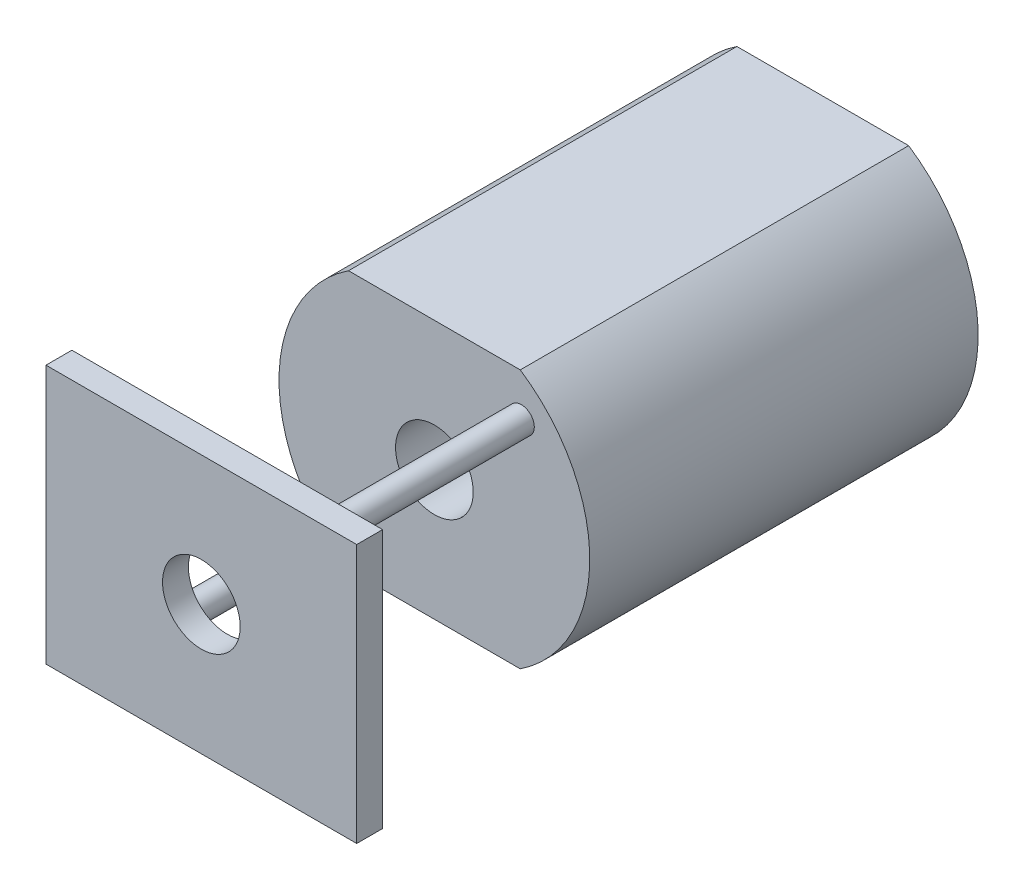
ISO-10303-21;
HEADER;
FILE_DESCRIPTION(('STEP AP214'),'2;1');
FILE_NAME('part.step','',(''),(''),'','','');
FILE_SCHEMA(('AUTOMOTIVE_DESIGN { 1 0 10303 214 1 1 1 1 }'));
ENDSEC;
DATA;
#1=APPLICATION_CONTEXT('core data for automotive mechanical design processes');
#2=APPLICATION_PROTOCOL_DEFINITION('international standard','automotive_design',2000,#1);
#3=PRODUCT_CONTEXT('',#1,'mechanical');
#4=PRODUCT('Part','Part','',(#3));
#5=PRODUCT_RELATED_PRODUCT_CATEGORY('part','',(#4));
#6=PRODUCT_DEFINITION_FORMATION('','',#4);
#7=PRODUCT_DEFINITION_CONTEXT('part definition',#1,'design');
#8=PRODUCT_DEFINITION('design','',#6,#7);
#9=PRODUCT_DEFINITION_SHAPE('','',#8);
#10=(LENGTH_UNIT() NAMED_UNIT(*) SI_UNIT(.MILLI.,.METRE.));
#11=(NAMED_UNIT(*) PLANE_ANGLE_UNIT() SI_UNIT($,.RADIAN.));
#12=(NAMED_UNIT(*) SI_UNIT($,.STERADIAN.) SOLID_ANGLE_UNIT());
#13=UNCERTAINTY_MEASURE_WITH_UNIT(LENGTH_MEASURE(1.E-05),#10,'distance_accuracy_value','');
#14=(GEOMETRIC_REPRESENTATION_CONTEXT(3) GLOBAL_UNCERTAINTY_ASSIGNED_CONTEXT((#13)) GLOBAL_UNIT_ASSIGNED_CONTEXT((#10,
#11,#12)) REPRESENTATION_CONTEXT('',''));
#15=CARTESIAN_POINT('',(0.,0.,0.));
#16=DIRECTION('',(0.,0.,1.));
#17=DIRECTION('',(1.,0.,0.));
#18=AXIS2_PLACEMENT_3D('',#15,#16,#17);
#19=CARTESIAN_POINT('',(0.,0.,7.5));
#20=DIRECTION('',(0.,0.,-1.));
#21=DIRECTION('',(-1.,0.,0.));
#22=AXIS2_PLACEMENT_3D('',#19,#20,#21);
#23=CYLINDRICAL_SURFACE('',#22,6.);
#24=CARTESIAN_POINT('',(0.,0.,-7.5));
#25=DIRECTION('',(0.,0.,1.));
#26=DIRECTION('',(1.,0.,0.));
#27=AXIS2_PLACEMENT_3D('',#24,#25,#26);
#28=CIRCLE('',#27,6.);
#29=CARTESIAN_POINT('',(-3.3166247903554,5.,-7.5));
#30=VERTEX_POINT('',#29);
#31=CARTESIAN_POINT('',(-3.3166247903554,-5.,-7.5));
#32=VERTEX_POINT('',#31);
#33=EDGE_CURVE('E172',#30,#32,#28,.T.);
#34=ORIENTED_EDGE('',*,*,#33,.T.);
#35=DIRECTION('',(0.,0.,-1.));
#36=VECTOR('',#35,1.);
#37=CARTESIAN_POINT('',(-3.3166247903554,-5.,7.5));
#38=LINE('',#37,#36);
#39=CARTESIAN_POINT('',(-3.3166247903554,-5.,7.5));
#40=VERTEX_POINT('',#39);
#41=EDGE_CURVE('E48',#40,#32,#38,.T.);
#42=ORIENTED_EDGE('',*,*,#41,.F.);
#43=CARTESIAN_POINT('',(0.,0.,7.5));
#44=DIRECTION('',(0.,0.,1.));
#45=DIRECTION('',(1.,0.,0.));
#46=AXIS2_PLACEMENT_3D('',#43,#44,#45);
#47=CIRCLE('',#46,6.);
#48=CARTESIAN_POINT('',(-3.3166247903554,5.,7.5));
#49=VERTEX_POINT('',#48);
#50=EDGE_CURVE('E174',#49,#40,#47,.T.);
#51=ORIENTED_EDGE('',*,*,#50,.F.);
#52=DIRECTION('',(0.,0.,-1.));
#53=VECTOR('',#52,1.);
#54=CARTESIAN_POINT('',(-3.3166247903554,5.,7.5));
#55=LINE('',#54,#53);
#56=EDGE_CURVE('E180',#49,#30,#55,.T.);
#57=ORIENTED_EDGE('',*,*,#56,.T.);
#58=EDGE_LOOP('',(#34,#42,#51,#57));
#59=FACE_BOUND('',#58,.T.);
#60=ADVANCED_FACE('F39',(#59),#23,.T.);
#61=CARTESIAN_POINT('',(-3.3166247903554,-5.,7.5));
#62=DIRECTION('',(0.,1.,0.));
#63=DIRECTION('',(0.,0.,1.));
#64=AXIS2_PLACEMENT_3D('',#61,#62,#63);
#65=PLANE('',#64);
#66=DIRECTION('',(1.,0.,0.));
#67=VECTOR('',#66,1.);
#68=CARTESIAN_POINT('',(-3.3166247903554,-5.,-7.5));
#69=LINE('',#68,#67);
#70=CARTESIAN_POINT('',(3.3166247903554,-5.,-7.5));
#71=VERTEX_POINT('',#70);
#72=EDGE_CURVE('E183',#32,#71,#69,.T.);
#73=ORIENTED_EDGE('',*,*,#72,.T.);
#74=DIRECTION('',(0.,0.,-1.));
#75=VECTOR('',#74,1.);
#76=CARTESIAN_POINT('',(3.3166247903554,-5.,7.5));
#77=LINE('',#76,#75);
#78=CARTESIAN_POINT('',(3.3166247903554,-5.,7.5));
#79=VERTEX_POINT('',#78);
#80=EDGE_CURVE('E190',#79,#71,#77,.T.);
#81=ORIENTED_EDGE('',*,*,#80,.F.);
#82=DIRECTION('',(1.,0.,0.));
#83=VECTOR('',#82,1.);
#84=CARTESIAN_POINT('',(-3.3166247903554,-5.,7.5));
#85=LINE('',#84,#83);
#86=EDGE_CURVE('E89',#40,#79,#85,.T.);
#87=ORIENTED_EDGE('',*,*,#86,.F.);
#88=ORIENTED_EDGE('',*,*,#41,.T.);
#89=EDGE_LOOP('',(#73,#81,#87,#88));
#90=FACE_BOUND('',#89,.T.);
#91=ADVANCED_FACE('F192',(#90),#65,.F.);
#92=CARTESIAN_POINT('',(0.,0.,7.5));
#93=DIRECTION('',(0.,0.,-1.));
#94=DIRECTION('',(-1.,0.,0.));
#95=AXIS2_PLACEMENT_3D('',#92,#93,#94);
#96=CYLINDRICAL_SURFACE('',#95,6.);
#97=CARTESIAN_POINT('',(0.,0.,-7.5));
#98=DIRECTION('',(0.,0.,1.));
#99=DIRECTION('',(1.,0.,0.));
#100=AXIS2_PLACEMENT_3D('',#97,#98,#99);
#101=CIRCLE('',#100,6.);
#102=CARTESIAN_POINT('',(3.3166247903554,5.,-7.5));
#103=VERTEX_POINT('',#102);
#104=EDGE_CURVE('E75',#71,#103,#101,.T.);
#105=ORIENTED_EDGE('',*,*,#104,.T.);
#106=DIRECTION('',(0.,0.,-1.));
#107=VECTOR('',#106,1.);
#108=CARTESIAN_POINT('',(3.3166247903554,5.,7.5));
#109=LINE('',#108,#107);
#110=CARTESIAN_POINT('',(3.3166247903554,5.,7.5));
#111=VERTEX_POINT('',#110);
#112=EDGE_CURVE('E188',#111,#103,#109,.T.);
#113=ORIENTED_EDGE('',*,*,#112,.F.);
#114=CARTESIAN_POINT('',(0.,0.,7.5));
#115=DIRECTION('',(0.,0.,1.));
#116=DIRECTION('',(1.,0.,0.));
#117=AXIS2_PLACEMENT_3D('',#114,#115,#116);
#118=CIRCLE('',#117,6.);
#119=EDGE_CURVE('E177',#79,#111,#118,.T.);
#120=ORIENTED_EDGE('',*,*,#119,.F.);
#121=ORIENTED_EDGE('',*,*,#80,.T.);
#122=EDGE_LOOP('',(#105,#113,#120,#121));
#123=FACE_BOUND('',#122,.T.);
#124=ADVANCED_FACE('F219',(#123),#96,.T.);
#125=CARTESIAN_POINT('',(-3.3166247903554,5.,7.5));
#126=DIRECTION('',(0.,-1.,0.));
#127=DIRECTION('',(0.,0.,-1.));
#128=AXIS2_PLACEMENT_3D('',#125,#126,#127);
#129=PLANE('',#128);
#130=DIRECTION('',(-1.,0.,0.));
#131=VECTOR('',#130,1.);
#132=CARTESIAN_POINT('',(-3.3166247903554,5.,-7.5));
#133=LINE('',#132,#131);
#134=EDGE_CURVE('E81',#103,#30,#133,.T.);
#135=ORIENTED_EDGE('',*,*,#134,.T.);
#136=ORIENTED_EDGE('',*,*,#56,.F.);
#137=DIRECTION('',(-1.,0.,0.));
#138=VECTOR('',#137,1.);
#139=CARTESIAN_POINT('',(-3.3166247903554,5.,7.5));
#140=LINE('',#139,#138);
#141=EDGE_CURVE('E57',#111,#49,#140,.T.);
#142=ORIENTED_EDGE('',*,*,#141,.F.);
#143=ORIENTED_EDGE('',*,*,#112,.T.);
#144=EDGE_LOOP('',(#135,#136,#142,#143));
#145=FACE_BOUND('',#144,.T.);
#146=ADVANCED_FACE('F210',(#145),#129,.F.);
#147=CARTESIAN_POINT('',(0.,0.,7.5));
#148=DIRECTION('',(0.,0.,1.));
#149=DIRECTION('',(1.,0.,0.));
#150=AXIS2_PLACEMENT_3D('',#147,#148,#149);
#151=PLANE('',#150);
#152=CARTESIAN_POINT('',(0.,0.,7.5));
#153=DIRECTION('',(0.,0.,1.));
#154=DIRECTION('',(1.,0.,0.));
#155=AXIS2_PLACEMENT_3D('',#152,#153,#154);
#156=CIRCLE('',#155,1.5);
#157=CARTESIAN_POINT('',(1.5,0.,7.5));
#158=VERTEX_POINT('',#157);
#159=EDGE_CURVE('E147',#158,#158,#156,.T.);
#160=ORIENTED_EDGE('',*,*,#159,.F.);
#161=EDGE_LOOP('',(#160));
#162=FACE_BOUND('',#161,.T.);
#163=CARTESIAN_POINT('',(-3.35875721063612,-3.35875721063608,7.5));
#164=DIRECTION('',(0.,0.,1.));
#165=DIRECTION('',(1.,0.,0.));
#166=AXIS2_PLACEMENT_3D('',#163,#164,#165);
#167=CIRCLE('',#166,0.5);
#168=CARTESIAN_POINT('',(-2.85875721063612,-3.35875721063608,7.5));
#169=VERTEX_POINT('',#168);
#170=EDGE_CURVE('E164',#169,#169,#167,.T.);
#171=ORIENTED_EDGE('',*,*,#170,.F.);
#172=EDGE_LOOP('',(#171));
#173=FACE_BOUND('',#172,.T.);
#174=CARTESIAN_POINT('',(3.35875721063612,3.35875721063608,7.5));
#175=DIRECTION('',(0.,0.,1.));
#176=DIRECTION('',(1.,0.,0.));
#177=AXIS2_PLACEMENT_3D('',#174,#175,#176);
#178=CIRCLE('',#177,0.5);
#179=CARTESIAN_POINT('',(3.85875721063612,3.35875721063608,7.5));
#180=VERTEX_POINT('',#179);
#181=EDGE_CURVE('E167',#180,#180,#178,.T.);
#182=ORIENTED_EDGE('',*,*,#181,.F.);
#183=EDGE_LOOP('',(#182));
#184=FACE_BOUND('',#183,.T.);
#185=ORIENTED_EDGE('',*,*,#50,.T.);
#186=ORIENTED_EDGE('',*,*,#86,.T.);
#187=ORIENTED_EDGE('',*,*,#119,.T.);
#188=ORIENTED_EDGE('',*,*,#141,.T.);
#189=EDGE_LOOP('',(#185,#186,#187,#188));
#190=FACE_BOUND('',#189,.T.);
#191=ADVANCED_FACE('F200',(#162,#173,#184,#190),#151,.T.);
#192=CARTESIAN_POINT('',(0.,0.,-7.5));
#193=DIRECTION('',(0.,0.,1.));
#194=DIRECTION('',(1.,0.,0.));
#195=AXIS2_PLACEMENT_3D('',#192,#193,#194);
#196=PLANE('',#195);
#197=CARTESIAN_POINT('',(0.,0.,-7.5));
#198=DIRECTION('',(0.,0.,-1.));
#199=DIRECTION('',(-1.,0.,0.));
#200=AXIS2_PLACEMENT_3D('',#197,#198,#199);
#201=CIRCLE('',#200,2.5);
#202=CARTESIAN_POINT('',(-2.5,0.,-7.5));
#203=VERTEX_POINT('',#202);
#204=EDGE_CURVE('E11',#203,#203,#201,.T.);
#205=ORIENTED_EDGE('',*,*,#204,.F.);
#206=EDGE_LOOP('',(#205));
#207=FACE_BOUND('',#206,.T.);
#208=ORIENTED_EDGE('',*,*,#33,.F.);
#209=ORIENTED_EDGE('',*,*,#134,.F.);
#210=ORIENTED_EDGE('',*,*,#104,.F.);
#211=ORIENTED_EDGE('',*,*,#72,.F.);
#212=EDGE_LOOP('',(#208,#209,#210,#211));
#213=FACE_BOUND('',#212,.T.);
#214=ADVANCED_FACE('F197',(#207,#213),#196,.F.);
#215=CARTESIAN_POINT('',(0.,0.,-8.5));
#216=DIRECTION('',(0.,0.,1.));
#217=DIRECTION('',(1.,0.,0.));
#218=AXIS2_PLACEMENT_3D('',#215,#216,#217);
#219=CYLINDRICAL_SURFACE('',#218,2.5);
#220=CARTESIAN_POINT('',(0.,0.,-8.5));
#221=DIRECTION('',(0.,0.,-1.));
#222=DIRECTION('',(-1.,0.,0.));
#223=AXIS2_PLACEMENT_3D('',#220,#221,#222);
#224=CIRCLE('',#223,2.5);
#225=CARTESIAN_POINT('',(-2.5,0.,-8.5));
#226=VERTEX_POINT('',#225);
#227=EDGE_CURVE('E170',#226,#226,#224,.T.);
#228=ORIENTED_EDGE('',*,*,#227,.F.);
#229=EDGE_LOOP('',(#228));
#230=FACE_BOUND('',#229,.T.);
#231=ORIENTED_EDGE('',*,*,#204,.T.);
#232=EDGE_LOOP('',(#231));
#233=FACE_BOUND('',#232,.T.);
#234=ADVANCED_FACE('F199',(#230,#233),#219,.T.);
#235=CARTESIAN_POINT('',(0.,0.,-8.5));
#236=DIRECTION('',(0.,0.,-1.));
#237=DIRECTION('',(-1.,0.,0.));
#238=AXIS2_PLACEMENT_3D('',#235,#236,#237);
#239=PLANE('',#238);
#240=CARTESIAN_POINT('',(0.,0.,-8.5));
#241=DIRECTION('',(0.,0.,1.));
#242=DIRECTION('',(1.,0.,0.));
#243=AXIS2_PLACEMENT_3D('',#240,#241,#242);
#244=CIRCLE('',#243,1.5);
#245=CARTESIAN_POINT('',(1.5,0.,-8.5));
#246=VERTEX_POINT('',#245);
#247=EDGE_CURVE('E426',#246,#246,#244,.T.);
#248=ORIENTED_EDGE('',*,*,#247,.T.);
#249=EDGE_LOOP('',(#248));
#250=FACE_BOUND('',#249,.T.);
#251=ORIENTED_EDGE('',*,*,#227,.T.);
#252=EDGE_LOOP('',(#251));
#253=FACE_BOUND('',#252,.T.);
#254=ADVANCED_FACE('F207',(#250,#253),#239,.T.);
#255=CARTESIAN_POINT('',(3.35875721063612,3.35875721063608,16.5));
#256=DIRECTION('',(0.,0.,-1.));
#257=DIRECTION('',(-1.,0.,0.));
#258=AXIS2_PLACEMENT_3D('',#255,#256,#257);
#259=CYLINDRICAL_SURFACE('',#258,0.5);
#260=CARTESIAN_POINT('',(3.35875721063612,3.35875721063608,15.5));
#261=DIRECTION('',(0.,0.,-1.));
#262=DIRECTION('',(-1.,0.,0.));
#263=AXIS2_PLACEMENT_3D('',#260,#261,#262);
#264=CIRCLE('',#263,0.5);
#265=CARTESIAN_POINT('',(2.85875721063612,3.35875721063608,15.5));
#266=VERTEX_POINT('',#265);
#267=EDGE_CURVE('E161',#266,#266,#264,.T.);
#268=ORIENTED_EDGE('',*,*,#267,.T.);
#269=EDGE_LOOP('',(#268));
#270=FACE_BOUND('',#269,.T.);
#271=ORIENTED_EDGE('',*,*,#181,.T.);
#272=EDGE_LOOP('',(#271));
#273=FACE_BOUND('',#272,.T.);
#274=ADVANCED_FACE('F249',(#270,#273),#259,.T.);
#275=CARTESIAN_POINT('',(-3.35875721063612,-3.35875721063608,16.5));
#276=DIRECTION('',(0.,0.,-1.));
#277=DIRECTION('',(-1.,0.,0.));
#278=AXIS2_PLACEMENT_3D('',#275,#276,#277);
#279=CYLINDRICAL_SURFACE('',#278,0.5);
#280=CARTESIAN_POINT('',(-3.35875721063612,-3.35875721063608,15.5));
#281=DIRECTION('',(0.,0.,-1.));
#282=DIRECTION('',(-1.,0.,0.));
#283=AXIS2_PLACEMENT_3D('',#280,#281,#282);
#284=CIRCLE('',#283,0.5);
#285=CARTESIAN_POINT('',(-3.85875721063612,-3.35875721063608,15.5));
#286=VERTEX_POINT('',#285);
#287=EDGE_CURVE('E42',#286,#286,#284,.T.);
#288=ORIENTED_EDGE('',*,*,#287,.T.);
#289=EDGE_LOOP('',(#288));
#290=FACE_BOUND('',#289,.T.);
#291=ORIENTED_EDGE('',*,*,#170,.T.);
#292=EDGE_LOOP('',(#291));
#293=FACE_BOUND('',#292,.T.);
#294=ADVANCED_FACE('F332',(#290,#293),#279,.T.);
#295=CARTESIAN_POINT('',(6.,-5.,15.5));
#296=DIRECTION('',(1.,0.,0.));
#297=DIRECTION('',(0.,0.,-1.));
#298=AXIS2_PLACEMENT_3D('',#295,#296,#297);
#299=PLANE('',#298);
#300=DIRECTION('',(0.,1.,0.));
#301=VECTOR('',#300,1.);
#302=CARTESIAN_POINT('',(6.,-5.,16.5));
#303=LINE('',#302,#301);
#304=CARTESIAN_POINT('',(6.,-5.,16.5));
#305=VERTEX_POINT('',#304);
#306=CARTESIAN_POINT('',(6.,5.,16.5));
#307=VERTEX_POINT('',#306);
#308=EDGE_CURVE('E152',#305,#307,#303,.T.);
#309=ORIENTED_EDGE('',*,*,#308,.F.);
#310=DIRECTION('',(0.,0.,1.));
#311=VECTOR('',#310,1.);
#312=CARTESIAN_POINT('',(6.,-5.,15.5));
#313=LINE('',#312,#311);
#314=CARTESIAN_POINT('',(6.,-5.,15.5));
#315=VERTEX_POINT('',#314);
#316=EDGE_CURVE('E140',#315,#305,#313,.T.);
#317=ORIENTED_EDGE('',*,*,#316,.F.);
#318=DIRECTION('',(0.,1.,0.));
#319=VECTOR('',#318,1.);
#320=CARTESIAN_POINT('',(6.,-5.,15.5));
#321=LINE('',#320,#319);
#322=CARTESIAN_POINT('',(6.,5.,15.5));
#323=VERTEX_POINT('',#322);
#324=EDGE_CURVE('E134',#315,#323,#321,.T.);
#325=ORIENTED_EDGE('',*,*,#324,.T.);
#326=DIRECTION('',(0.,0.,1.));
#327=VECTOR('',#326,1.);
#328=CARTESIAN_POINT('',(6.,5.,15.5));
#329=LINE('',#328,#327);
#330=EDGE_CURVE('E116',#323,#307,#329,.T.);
#331=ORIENTED_EDGE('',*,*,#330,.T.);
#332=EDGE_LOOP('',(#309,#317,#325,#331));
#333=FACE_BOUND('',#332,.T.);
#334=ADVANCED_FACE('F139',(#333),#299,.T.);
#335=CARTESIAN_POINT('',(-6.,-5.,15.5));
#336=DIRECTION('',(0.,-1.,0.));
#337=DIRECTION('',(0.,0.,-1.));
#338=AXIS2_PLACEMENT_3D('',#335,#336,#337);
#339=PLANE('',#338);
#340=DIRECTION('',(1.,0.,0.));
#341=VECTOR('',#340,1.);
#342=CARTESIAN_POINT('',(-6.,-5.,16.5));
#343=LINE('',#342,#341);
#344=CARTESIAN_POINT('',(-6.,-5.,16.5));
#345=VERTEX_POINT('',#344);
#346=EDGE_CURVE('E141',#345,#305,#343,.T.);
#347=ORIENTED_EDGE('',*,*,#346,.F.);
#348=DIRECTION('',(0.,0.,1.));
#349=VECTOR('',#348,1.);
#350=CARTESIAN_POINT('',(-6.,-5.,15.5));
#351=LINE('',#350,#349);
#352=CARTESIAN_POINT('',(-6.,-5.,15.5));
#353=VERTEX_POINT('',#352);
#354=EDGE_CURVE('E158',#353,#345,#351,.T.);
#355=ORIENTED_EDGE('',*,*,#354,.F.);
#356=DIRECTION('',(1.,0.,0.));
#357=VECTOR('',#356,1.);
#358=CARTESIAN_POINT('',(-6.,-5.,15.5));
#359=LINE('',#358,#357);
#360=EDGE_CURVE('E127',#353,#315,#359,.T.);
#361=ORIENTED_EDGE('',*,*,#360,.T.);
#362=ORIENTED_EDGE('',*,*,#316,.T.);
#363=EDGE_LOOP('',(#347,#355,#361,#362));
#364=FACE_BOUND('',#363,.T.);
#365=ADVANCED_FACE('F314',(#364),#339,.T.);
#366=CARTESIAN_POINT('',(-6.,-5.,15.5));
#367=DIRECTION('',(-1.,0.,0.));
#368=DIRECTION('',(0.,0.,1.));
#369=AXIS2_PLACEMENT_3D('',#366,#367,#368);
#370=PLANE('',#369);
#371=DIRECTION('',(0.,-1.,0.));
#372=VECTOR('',#371,1.);
#373=CARTESIAN_POINT('',(-6.,-5.,16.5));
#374=LINE('',#373,#372);
#375=CARTESIAN_POINT('',(-6.,5.,16.5));
#376=VERTEX_POINT('',#375);
#377=EDGE_CURVE('E144',#376,#345,#374,.T.);
#378=ORIENTED_EDGE('',*,*,#377,.F.);
#379=DIRECTION('',(0.,0.,1.));
#380=VECTOR('',#379,1.);
#381=CARTESIAN_POINT('',(-6.,5.,15.5));
#382=LINE('',#381,#380);
#383=CARTESIAN_POINT('',(-6.,5.,15.5));
#384=VERTEX_POINT('',#383);
#385=EDGE_CURVE('E126',#384,#376,#382,.T.);
#386=ORIENTED_EDGE('',*,*,#385,.F.);
#387=DIRECTION('',(0.,-1.,0.));
#388=VECTOR('',#387,1.);
#389=CARTESIAN_POINT('',(-6.,-5.,15.5));
#390=LINE('',#389,#388);
#391=EDGE_CURVE('E137',#384,#353,#390,.T.);
#392=ORIENTED_EDGE('',*,*,#391,.T.);
#393=ORIENTED_EDGE('',*,*,#354,.T.);
#394=EDGE_LOOP('',(#378,#386,#392,#393));
#395=FACE_BOUND('',#394,.T.);
#396=ADVANCED_FACE('F306',(#395),#370,.T.);
#397=CARTESIAN_POINT('',(-6.,5.,15.5));
#398=DIRECTION('',(0.,1.,0.));
#399=DIRECTION('',(0.,0.,1.));
#400=AXIS2_PLACEMENT_3D('',#397,#398,#399);
#401=PLANE('',#400);
#402=DIRECTION('',(-1.,0.,0.));
#403=VECTOR('',#402,1.);
#404=CARTESIAN_POINT('',(-6.,5.,16.5));
#405=LINE('',#404,#403);
#406=EDGE_CURVE('E121',#307,#376,#405,.T.);
#407=ORIENTED_EDGE('',*,*,#406,.F.);
#408=ORIENTED_EDGE('',*,*,#330,.F.);
#409=DIRECTION('',(-1.,0.,0.));
#410=VECTOR('',#409,1.);
#411=CARTESIAN_POINT('',(-6.,5.,15.5));
#412=LINE('',#411,#410);
#413=EDGE_CURVE('E119',#323,#384,#412,.T.);
#414=ORIENTED_EDGE('',*,*,#413,.T.);
#415=ORIENTED_EDGE('',*,*,#385,.T.);
#416=EDGE_LOOP('',(#407,#408,#414,#415));
#417=FACE_BOUND('',#416,.T.);
#418=ADVANCED_FACE('F118',(#417),#401,.T.);
#419=CARTESIAN_POINT('',(0.,0.,15.5));
#420=DIRECTION('',(0.,0.,-1.));
#421=DIRECTION('',(-1.,0.,0.));
#422=AXIS2_PLACEMENT_3D('',#419,#420,#421);
#423=PLANE('',#422);
#424=CARTESIAN_POINT('',(0.,0.,15.5));
#425=DIRECTION('',(0.,0.,-1.));
#426=DIRECTION('',(-1.,0.,0.));
#427=AXIS2_PLACEMENT_3D('',#424,#425,#426);
#428=CIRCLE('',#427,1.5);
#429=CARTESIAN_POINT('',(-1.5,0.,15.5));
#430=VERTEX_POINT('',#429);
#431=EDGE_CURVE('E427',#430,#430,#428,.T.);
#432=ORIENTED_EDGE('',*,*,#431,.F.);
#433=EDGE_LOOP('',(#432));
#434=FACE_BOUND('',#433,.T.);
#435=ORIENTED_EDGE('',*,*,#267,.F.);
#436=EDGE_LOOP('',(#435));
#437=FACE_BOUND('',#436,.T.);
#438=ORIENTED_EDGE('',*,*,#287,.F.);
#439=EDGE_LOOP('',(#438));
#440=FACE_BOUND('',#439,.T.);
#441=ORIENTED_EDGE('',*,*,#324,.F.);
#442=ORIENTED_EDGE('',*,*,#360,.F.);
#443=ORIENTED_EDGE('',*,*,#391,.F.);
#444=ORIENTED_EDGE('',*,*,#413,.F.);
#445=EDGE_LOOP('',(#441,#442,#443,#444));
#446=FACE_BOUND('',#445,.T.);
#447=ADVANCED_FACE('F132',(#434,#437,#440,#446),#423,.T.);
#448=CARTESIAN_POINT('',(3.35875721063612,3.35875721063608,16.5));
#449=DIRECTION('',(0.,0.,1.));
#450=DIRECTION('',(1.,0.,0.));
#451=AXIS2_PLACEMENT_3D('',#448,#449,#450);
#452=PLANE('',#451);
#453=CARTESIAN_POINT('',(0.,0.,16.5));
#454=DIRECTION('',(0.,0.,1.));
#455=DIRECTION('',(1.,0.,0.));
#456=AXIS2_PLACEMENT_3D('',#453,#454,#455);
#457=CIRCLE('',#456,1.5);
#458=CARTESIAN_POINT('',(1.5,0.,16.5));
#459=VERTEX_POINT('',#458);
#460=EDGE_CURVE('E428',#459,#459,#457,.T.);
#461=ORIENTED_EDGE('',*,*,#460,.F.);
#462=EDGE_LOOP('',(#461));
#463=FACE_BOUND('',#462,.T.);
#464=ORIENTED_EDGE('',*,*,#308,.T.);
#465=ORIENTED_EDGE('',*,*,#406,.T.);
#466=ORIENTED_EDGE('',*,*,#377,.T.);
#467=ORIENTED_EDGE('',*,*,#346,.T.);
#468=EDGE_LOOP('',(#464,#465,#466,#467));
#469=FACE_BOUND('',#468,.T.);
#470=ADVANCED_FACE('F263',(#463,#469),#452,.T.);
#471=CARTESIAN_POINT('',(0.,0.,-8.5));
#472=DIRECTION('',(0.,0.,1.));
#473=DIRECTION('',(1.,0.,0.));
#474=AXIS2_PLACEMENT_3D('',#471,#472,#473);
#475=CYLINDRICAL_SURFACE('',#474,1.5);
#476=ORIENTED_EDGE('',*,*,#431,.T.);
#477=EDGE_LOOP('',(#476));
#478=FACE_BOUND('',#477,.T.);
#479=ORIENTED_EDGE('',*,*,#460,.T.);
#480=EDGE_LOOP('',(#479));
#481=FACE_BOUND('',#480,.T.);
#482=ADVANCED_FACE('F274',(#478,#481),#475,.F.);
#483=ORIENTED_EDGE('',*,*,#159,.T.);
#484=EDGE_LOOP('',(#483));
#485=FACE_BOUND('',#484,.T.);
#486=ORIENTED_EDGE('',*,*,#247,.F.);
#487=EDGE_LOOP('',(#486));
#488=FACE_BOUND('',#487,.T.);
#489=ADVANCED_FACE('F285',(#485,#488),#475,.F.);
#490=CLOSED_SHELL('',(#60,#91,#124,#146,#191,#214,#234,#254,#274,#294,#334,#365,#396,#418,#447,
#470,#482,#489));
#491=MANIFOLD_SOLID_BREP('B2',#490);
#492=ADVANCED_BREP_SHAPE_REPRESENTATION('',(#18,#491),#14);
#493=SHAPE_DEFINITION_REPRESENTATION(#9,#492);
ENDSEC;
END-ISO-10303-21;
